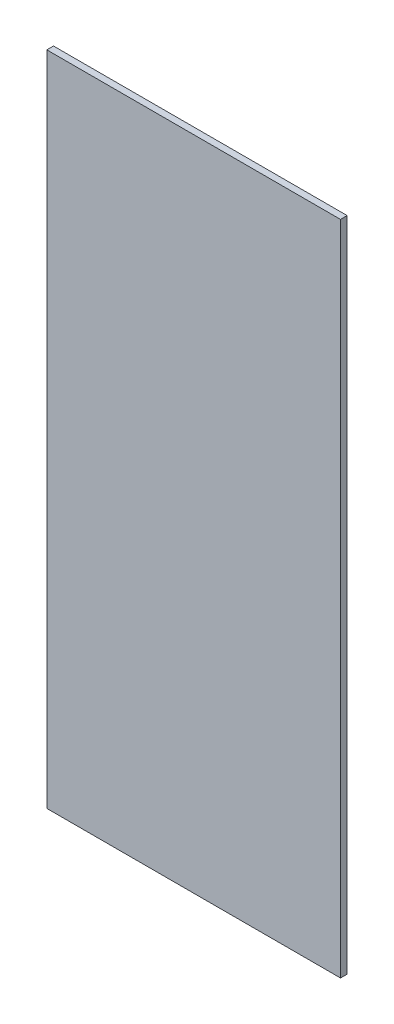
ISO-10303-21;
HEADER;
FILE_DESCRIPTION(('STEP AP214'),'2;1');
FILE_NAME('part.step','',(''),(''),'','','');
FILE_SCHEMA(('AUTOMOTIVE_DESIGN { 1 0 10303 214 1 1 1 1 }'));
ENDSEC;
DATA;
#1=APPLICATION_CONTEXT('core data for automotive mechanical design processes');
#2=APPLICATION_PROTOCOL_DEFINITION('international standard','automotive_design',2000,#1);
#3=PRODUCT_CONTEXT('',#1,'mechanical');
#4=PRODUCT('Part','Part','',(#3));
#5=PRODUCT_RELATED_PRODUCT_CATEGORY('part','',(#4));
#6=PRODUCT_DEFINITION_FORMATION('','',#4);
#7=PRODUCT_DEFINITION_CONTEXT('part definition',#1,'design');
#8=PRODUCT_DEFINITION('design','',#6,#7);
#9=PRODUCT_DEFINITION_SHAPE('','',#8);
#10=(LENGTH_UNIT() NAMED_UNIT(*) SI_UNIT(.MILLI.,.METRE.));
#11=(NAMED_UNIT(*) PLANE_ANGLE_UNIT() SI_UNIT($,.RADIAN.));
#12=(NAMED_UNIT(*) SI_UNIT($,.STERADIAN.) SOLID_ANGLE_UNIT());
#13=UNCERTAINTY_MEASURE_WITH_UNIT(LENGTH_MEASURE(1.E-05),#10,'distance_accuracy_value','');
#14=(GEOMETRIC_REPRESENTATION_CONTEXT(3) GLOBAL_UNCERTAINTY_ASSIGNED_CONTEXT((#13)) GLOBAL_UNIT_ASSIGNED_CONTEXT((#10,
#11,#12)) REPRESENTATION_CONTEXT('',''));
#15=CARTESIAN_POINT('',(0.,0.,0.));
#16=DIRECTION('',(0.,0.,1.));
#17=DIRECTION('',(1.,0.,0.));
#18=AXIS2_PLACEMENT_3D('',#15,#16,#17);
#19=CARTESIAN_POINT('',(-88.2,0.,4.));
#20=DIRECTION('',(1.,0.,0.));
#21=DIRECTION('',(0.,1.,0.));
#22=AXIS2_PLACEMENT_3D('',#19,#20,#21);
#23=PLANE('',#22);
#24=DIRECTION('',(0.,-1.,0.));
#25=VECTOR('',#24,1.);
#26=CARTESIAN_POINT('',(-88.2,0.,0.));
#27=LINE('',#26,#25);
#28=CARTESIAN_POINT('',(-88.2,0.,0.));
#29=VERTEX_POINT('',#28);
#30=CARTESIAN_POINT('',(-88.1999999999999,-394.6,0.));
#31=VERTEX_POINT('',#30);
#32=EDGE_CURVE('E97',#29,#31,#27,.T.);
#33=ORIENTED_EDGE('',*,*,#32,.T.);
#34=DIRECTION('',(0.,0.,-1.));
#35=VECTOR('',#34,1.);
#36=CARTESIAN_POINT('',(-88.1999999999999,-394.6,4.));
#37=LINE('',#36,#35);
#38=CARTESIAN_POINT('',(-88.1999999999999,-394.6,4.));
#39=VERTEX_POINT('',#38);
#40=EDGE_CURVE('E11',#39,#31,#37,.T.);
#41=ORIENTED_EDGE('',*,*,#40,.F.);
#42=DIRECTION('',(0.,-1.,0.));
#43=VECTOR('',#42,1.);
#44=CARTESIAN_POINT('',(-88.2,0.,4.));
#45=LINE('',#44,#43);
#46=CARTESIAN_POINT('',(-88.2,0.,4.));
#47=VERTEX_POINT('',#46);
#48=EDGE_CURVE('E85',#47,#39,#45,.T.);
#49=ORIENTED_EDGE('',*,*,#48,.F.);
#50=DIRECTION('',(0.,0.,-1.));
#51=VECTOR('',#50,1.);
#52=CARTESIAN_POINT('',(-88.2,0.,4.));
#53=LINE('',#52,#51);
#54=EDGE_CURVE('E93',#47,#29,#53,.T.);
#55=ORIENTED_EDGE('',*,*,#54,.T.);
#56=EDGE_LOOP('',(#33,#41,#49,#55));
#57=FACE_BOUND('',#56,.T.);
#58=ADVANCED_FACE('F34',(#57),#23,.F.);
#59=CARTESIAN_POINT('',(-88.1999999999999,-394.6,4.));
#60=DIRECTION('',(0.,1.,0.));
#61=DIRECTION('',(0.,0.,1.));
#62=AXIS2_PLACEMENT_3D('',#59,#60,#61);
#63=PLANE('',#62);
#64=DIRECTION('',(1.,0.,0.));
#65=VECTOR('',#64,1.);
#66=CARTESIAN_POINT('',(-88.1999999999999,-394.6,0.));
#67=LINE('',#66,#65);
#68=CARTESIAN_POINT('',(88.1999999999999,-394.6,0.));
#69=VERTEX_POINT('',#68);
#70=EDGE_CURVE('E89',#31,#69,#67,.T.);
#71=ORIENTED_EDGE('',*,*,#70,.T.);
#72=DIRECTION('',(0.,0.,-1.));
#73=VECTOR('',#72,1.);
#74=CARTESIAN_POINT('',(88.1999999999999,-394.6,4.));
#75=LINE('',#74,#73);
#76=CARTESIAN_POINT('',(88.1999999999999,-394.6,4.));
#77=VERTEX_POINT('',#76);
#78=EDGE_CURVE('E42',#77,#69,#75,.T.);
#79=ORIENTED_EDGE('',*,*,#78,.F.);
#80=DIRECTION('',(1.,0.,0.));
#81=VECTOR('',#80,1.);
#82=CARTESIAN_POINT('',(-88.1999999999999,-394.6,4.));
#83=LINE('',#82,#81);
#84=EDGE_CURVE('E80',#39,#77,#83,.T.);
#85=ORIENTED_EDGE('',*,*,#84,.F.);
#86=ORIENTED_EDGE('',*,*,#40,.T.);
#87=EDGE_LOOP('',(#71,#79,#85,#86));
#88=FACE_BOUND('',#87,.T.);
#89=ADVANCED_FACE('F88',(#88),#63,.F.);
#90=CARTESIAN_POINT('',(88.2,0.,4.));
#91=DIRECTION('',(-1.,0.,0.));
#92=DIRECTION('',(0.,-1.,0.));
#93=AXIS2_PLACEMENT_3D('',#90,#91,#92);
#94=PLANE('',#93);
#95=DIRECTION('',(0.,1.,0.));
#96=VECTOR('',#95,1.);
#97=CARTESIAN_POINT('',(88.2,0.,0.));
#98=LINE('',#97,#96);
#99=CARTESIAN_POINT('',(88.2,0.,0.));
#100=VERTEX_POINT('',#99);
#101=EDGE_CURVE('E67',#69,#100,#98,.T.);
#102=ORIENTED_EDGE('',*,*,#101,.T.);
#103=DIRECTION('',(0.,0.,-1.));
#104=VECTOR('',#103,1.);
#105=CARTESIAN_POINT('',(88.2,0.,4.));
#106=LINE('',#105,#104);
#107=CARTESIAN_POINT('',(88.2,0.,4.));
#108=VERTEX_POINT('',#107);
#109=EDGE_CURVE('E90',#108,#100,#106,.T.);
#110=ORIENTED_EDGE('',*,*,#109,.F.);
#111=DIRECTION('',(0.,1.,0.));
#112=VECTOR('',#111,1.);
#113=CARTESIAN_POINT('',(88.2,0.,4.));
#114=LINE('',#113,#112);
#115=EDGE_CURVE('E83',#77,#108,#114,.T.);
#116=ORIENTED_EDGE('',*,*,#115,.F.);
#117=ORIENTED_EDGE('',*,*,#78,.T.);
#118=EDGE_LOOP('',(#102,#110,#116,#117));
#119=FACE_BOUND('',#118,.T.);
#120=ADVANCED_FACE('F91',(#119),#94,.F.);
#121=CARTESIAN_POINT('',(-88.2,0.,4.));
#122=DIRECTION('',(0.,-1.,0.));
#123=DIRECTION('',(1.,0.,0.));
#124=AXIS2_PLACEMENT_3D('',#121,#122,#123);
#125=PLANE('',#124);
#126=DIRECTION('',(-1.,0.,0.));
#127=VECTOR('',#126,1.);
#128=CARTESIAN_POINT('',(-88.2,0.,0.));
#129=LINE('',#128,#127);
#130=EDGE_CURVE('E73',#100,#29,#129,.T.);
#131=ORIENTED_EDGE('',*,*,#130,.T.);
#132=ORIENTED_EDGE('',*,*,#54,.F.);
#133=DIRECTION('',(-1.,0.,0.));
#134=VECTOR('',#133,1.);
#135=CARTESIAN_POINT('',(-88.2,0.,4.));
#136=LINE('',#135,#134);
#137=EDGE_CURVE('E50',#108,#47,#136,.T.);
#138=ORIENTED_EDGE('',*,*,#137,.F.);
#139=ORIENTED_EDGE('',*,*,#109,.T.);
#140=EDGE_LOOP('',(#131,#132,#138,#139));
#141=FACE_BOUND('',#140,.T.);
#142=ADVANCED_FACE('F104',(#141),#125,.F.);
#143=CARTESIAN_POINT('',(0.,0.,4.));
#144=DIRECTION('',(0.,0.,1.));
#145=DIRECTION('',(1.,0.,0.));
#146=AXIS2_PLACEMENT_3D('',#143,#144,#145);
#147=PLANE('',#146);
#148=ORIENTED_EDGE('',*,*,#48,.T.);
#149=ORIENTED_EDGE('',*,*,#84,.T.);
#150=ORIENTED_EDGE('',*,*,#115,.T.);
#151=ORIENTED_EDGE('',*,*,#137,.T.);
#152=EDGE_LOOP('',(#148,#149,#150,#151));
#153=FACE_BOUND('',#152,.T.);
#154=ADVANCED_FACE('F81',(#153),#147,.T.);
#155=CARTESIAN_POINT('',(0.,0.,0.));
#156=DIRECTION('',(0.,0.,1.));
#157=DIRECTION('',(1.,0.,0.));
#158=AXIS2_PLACEMENT_3D('',#155,#156,#157);
#159=PLANE('',#158);
#160=ORIENTED_EDGE('',*,*,#32,.F.);
#161=ORIENTED_EDGE('',*,*,#130,.F.);
#162=ORIENTED_EDGE('',*,*,#101,.F.);
#163=ORIENTED_EDGE('',*,*,#70,.F.);
#164=EDGE_LOOP('',(#160,#161,#162,#163));
#165=FACE_BOUND('',#164,.T.);
#166=ADVANCED_FACE('F107',(#165),#159,.F.);
#167=CLOSED_SHELL('',(#58,#89,#120,#142,#154,#166));
#168=MANIFOLD_SOLID_BREP('B2',#167);
#169=ADVANCED_BREP_SHAPE_REPRESENTATION('',(#18,#168),#14);
#170=SHAPE_DEFINITION_REPRESENTATION(#9,#169);
ENDSEC;
END-ISO-10303-21;
